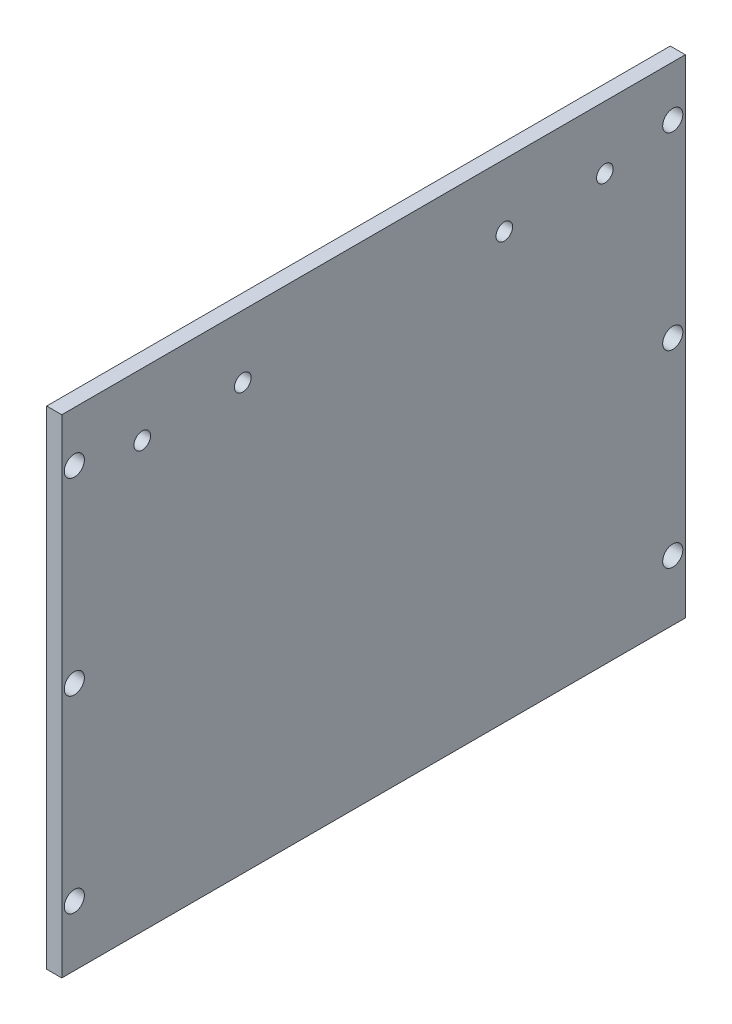
ISO-10303-21;
HEADER;
FILE_DESCRIPTION(('STEP AP214'),'2;1');
FILE_NAME('part.step','',(''),(''),'','','');
FILE_SCHEMA(('AUTOMOTIVE_DESIGN { 1 0 10303 214 1 1 1 1 }'));
ENDSEC;
DATA;
#1=APPLICATION_CONTEXT('core data for automotive mechanical design processes');
#2=APPLICATION_PROTOCOL_DEFINITION('international standard','automotive_design',2000,#1);
#3=PRODUCT_CONTEXT('',#1,'mechanical');
#4=PRODUCT('Part','Part','',(#3));
#5=PRODUCT_RELATED_PRODUCT_CATEGORY('part','',(#4));
#6=PRODUCT_DEFINITION_FORMATION('','',#4);
#7=PRODUCT_DEFINITION_CONTEXT('part definition',#1,'design');
#8=PRODUCT_DEFINITION('design','',#6,#7);
#9=PRODUCT_DEFINITION_SHAPE('','',#8);
#10=(LENGTH_UNIT() NAMED_UNIT(*) SI_UNIT(.MILLI.,.METRE.));
#11=(NAMED_UNIT(*) PLANE_ANGLE_UNIT() SI_UNIT($,.RADIAN.));
#12=(NAMED_UNIT(*) SI_UNIT($,.STERADIAN.) SOLID_ANGLE_UNIT());
#13=UNCERTAINTY_MEASURE_WITH_UNIT(LENGTH_MEASURE(1.E-05),#10,'distance_accuracy_value','');
#14=(GEOMETRIC_REPRESENTATION_CONTEXT(3) GLOBAL_UNCERTAINTY_ASSIGNED_CONTEXT((#13)) GLOBAL_UNIT_ASSIGNED_CONTEXT((#10,
#11,#12)) REPRESENTATION_CONTEXT('',''));
#15=CARTESIAN_POINT('',(0.,0.,0.));
#16=DIRECTION('',(0.,0.,1.));
#17=DIRECTION('',(1.,0.,0.));
#18=AXIS2_PLACEMENT_3D('',#15,#16,#17);
#19=CARTESIAN_POINT('',(2.99999999999993,2.98999999999998,-162.));
#20=DIRECTION('',(-1.,0.,0.));
#21=DIRECTION('',(0.,0.,1.));
#22=AXIS2_PLACEMENT_3D('',#19,#20,#21);
#23=PLANE('',#22);
#24=CARTESIAN_POINT('',(2.99999999999995,15.,-40.5));
#25=DIRECTION('',(1.,0.,0.));
#26=DIRECTION('',(0.,0.,-1.));
#27=AXIS2_PLACEMENT_3D('',#24,#25,#26);
#28=CIRCLE('',#27,1.99999999999999);
#29=CARTESIAN_POINT('',(2.99999999999995,15.,-42.5));
#30=VERTEX_POINT('',#29);
#31=EDGE_CURVE('E207',#30,#30,#28,.T.);
#32=ORIENTED_EDGE('',*,*,#31,.F.);
#33=EDGE_LOOP('',(#32));
#34=FACE_BOUND('',#33,.T.);
#35=CARTESIAN_POINT('',(2.99999999999994,15.,-159.5));
#36=DIRECTION('',(1.,0.,0.));
#37=DIRECTION('',(0.,0.,-1.));
#38=AXIS2_PLACEMENT_3D('',#35,#36,#37);
#39=CIRCLE('',#38,1.99999999999999);
#40=CARTESIAN_POINT('',(2.99999999999994,15.,-161.5));
#41=VERTEX_POINT('',#40);
#42=EDGE_CURVE('E213',#41,#41,#39,.T.);
#43=ORIENTED_EDGE('',*,*,#42,.F.);
#44=EDGE_LOOP('',(#43));
#45=FACE_BOUND('',#44,.T.);
#46=CARTESIAN_POINT('',(2.99999999999994,52.5,-159.5));
#47=DIRECTION('',(1.,0.,0.));
#48=DIRECTION('',(0.,0.,-1.));
#49=AXIS2_PLACEMENT_3D('',#46,#47,#48);
#50=CIRCLE('',#49,1.99999999999999);
#51=CARTESIAN_POINT('',(2.99999999999994,52.5,-161.5));
#52=VERTEX_POINT('',#51);
#53=EDGE_CURVE('E219',#52,#52,#50,.T.);
#54=ORIENTED_EDGE('',*,*,#53,.F.);
#55=EDGE_LOOP('',(#54));
#56=FACE_BOUND('',#55,.T.);
#57=CARTESIAN_POINT('',(2.99999999999994,90.,-159.5));
#58=DIRECTION('',(1.,0.,0.));
#59=DIRECTION('',(0.,0.,-1.));
#60=AXIS2_PLACEMENT_3D('',#57,#58,#59);
#61=CIRCLE('',#60,1.99999999999999);
#62=CARTESIAN_POINT('',(2.99999999999994,90.,-161.5));
#63=VERTEX_POINT('',#62);
#64=EDGE_CURVE('E225',#63,#63,#61,.T.);
#65=ORIENTED_EDGE('',*,*,#64,.F.);
#66=EDGE_LOOP('',(#65));
#67=FACE_BOUND('',#66,.T.);
#68=DIRECTION('',(0.,1.,0.));
#69=VECTOR('',#68,1.);
#70=CARTESIAN_POINT('',(2.99999999999993,2.98999999999998,-162.));
#71=LINE('',#70,#69);
#72=CARTESIAN_POINT('',(2.99999999999993,3.,-162.));
#73=VERTEX_POINT('',#72);
#74=CARTESIAN_POINT('',(2.99999999999993,100.,-162.));
#75=VERTEX_POINT('',#74);
#76=EDGE_CURVE('E41',#73,#75,#71,.T.);
#77=ORIENTED_EDGE('',*,*,#76,.T.);
#78=DIRECTION('',(0.,0.,1.));
#79=VECTOR('',#78,1.);
#80=CARTESIAN_POINT('',(2.99999999999993,100.,-157.));
#81=LINE('',#80,#79);
#82=CARTESIAN_POINT('',(2.99999999999995,100.,-38.));
#83=VERTEX_POINT('',#82);
#84=EDGE_CURVE('E81',#75,#83,#81,.T.);
#85=ORIENTED_EDGE('',*,*,#84,.T.);
#86=DIRECTION('',(0.,1.,0.));
#87=VECTOR('',#86,1.);
#88=CARTESIAN_POINT('',(2.99999999999994,2.98999999999998,-38.));
#89=LINE('',#88,#87);
#90=CARTESIAN_POINT('',(2.99999999999994,3.,-38.));
#91=VERTEX_POINT('',#90);
#92=EDGE_CURVE('E95',#91,#83,#89,.T.);
#93=ORIENTED_EDGE('',*,*,#92,.F.);
#94=DIRECTION('',(0.,0.,1.));
#95=VECTOR('',#94,1.);
#96=CARTESIAN_POINT('',(2.99999999999993,3.,-157.));
#97=LINE('',#96,#95);
#98=EDGE_CURVE('E92',#73,#91,#97,.T.);
#99=ORIENTED_EDGE('',*,*,#98,.F.);
#100=EDGE_LOOP('',(#77,#85,#93,#99));
#101=FACE_BOUND('',#100,.T.);
#102=CARTESIAN_POINT('',(2.99999999999993,87.56,-146.));
#103=DIRECTION('',(1.,0.,0.));
#104=DIRECTION('',(0.,0.,-1.));
#105=AXIS2_PLACEMENT_3D('',#102,#103,#104);
#106=CIRCLE('',#105,1.64999999999998);
#107=CARTESIAN_POINT('',(2.99999999999993,87.56,-147.65));
#108=VERTEX_POINT('',#107);
#109=EDGE_CURVE('E46',#108,#108,#106,.T.);
#110=ORIENTED_EDGE('',*,*,#109,.F.);
#111=EDGE_LOOP('',(#110));
#112=FACE_BOUND('',#111,.T.);
#113=CARTESIAN_POINT('',(2.99999999999993,87.56,-126.));
#114=DIRECTION('',(1.,0.,0.));
#115=DIRECTION('',(0.,0.,-1.));
#116=AXIS2_PLACEMENT_3D('',#113,#114,#115);
#117=CIRCLE('',#116,1.64999999999998);
#118=CARTESIAN_POINT('',(2.99999999999993,87.56,-127.65));
#119=VERTEX_POINT('',#118);
#120=EDGE_CURVE('E118',#119,#119,#117,.T.);
#121=ORIENTED_EDGE('',*,*,#120,.F.);
#122=EDGE_LOOP('',(#121));
#123=FACE_BOUND('',#122,.T.);
#124=CARTESIAN_POINT('',(2.99999999999994,87.56,-74.));
#125=DIRECTION('',(1.,0.,0.));
#126=DIRECTION('',(0.,0.,-1.));
#127=AXIS2_PLACEMENT_3D('',#124,#125,#126);
#128=CIRCLE('',#127,1.64999999999998);
#129=CARTESIAN_POINT('',(2.99999999999994,87.56,-75.65));
#130=VERTEX_POINT('',#129);
#131=EDGE_CURVE('E112',#130,#130,#128,.T.);
#132=ORIENTED_EDGE('',*,*,#131,.F.);
#133=EDGE_LOOP('',(#132));
#134=FACE_BOUND('',#133,.T.);
#135=CARTESIAN_POINT('',(2.99999999999994,87.56,-54.));
#136=DIRECTION('',(1.,0.,0.));
#137=DIRECTION('',(0.,0.,-1.));
#138=AXIS2_PLACEMENT_3D('',#135,#136,#137);
#139=CIRCLE('',#138,1.64999999999998);
#140=CARTESIAN_POINT('',(2.99999999999994,87.56,-55.65));
#141=VERTEX_POINT('',#140);
#142=EDGE_CURVE('E87',#141,#141,#139,.T.);
#143=ORIENTED_EDGE('',*,*,#142,.F.);
#144=EDGE_LOOP('',(#143));
#145=FACE_BOUND('',#144,.T.);
#146=CARTESIAN_POINT('',(2.99999999999995,52.5,-40.5));
#147=DIRECTION('',(1.,0.,0.));
#148=DIRECTION('',(0.,0.,-1.));
#149=AXIS2_PLACEMENT_3D('',#146,#147,#148);
#150=CIRCLE('',#149,1.99999999999999);
#151=CARTESIAN_POINT('',(2.99999999999995,52.5,-42.5));
#152=VERTEX_POINT('',#151);
#153=EDGE_CURVE('E193',#152,#152,#150,.T.);
#154=ORIENTED_EDGE('',*,*,#153,.F.);
#155=EDGE_LOOP('',(#154));
#156=FACE_BOUND('',#155,.T.);
#157=CARTESIAN_POINT('',(2.99999999999995,90.,-40.5));
#158=DIRECTION('',(1.,0.,0.));
#159=DIRECTION('',(0.,0.,-1.));
#160=AXIS2_PLACEMENT_3D('',#157,#158,#159);
#161=CIRCLE('',#160,1.99999999999999);
#162=CARTESIAN_POINT('',(2.99999999999995,90.,-42.5));
#163=VERTEX_POINT('',#162);
#164=EDGE_CURVE('E196',#163,#163,#161,.T.);
#165=ORIENTED_EDGE('',*,*,#164,.F.);
#166=EDGE_LOOP('',(#165));
#167=FACE_BOUND('',#166,.T.);
#168=ADVANCED_FACE('F37',(#34,#45,#56,#67,#101,#112,#123,#134,#145,#156,#167),#23,.F.);
#169=CARTESIAN_POINT('',(-6.75406545866244,2.98999999999998,-162.));
#170=DIRECTION('',(0.,0.,1.));
#171=DIRECTION('',(1.,0.,0.));
#172=AXIS2_PLACEMENT_3D('',#169,#170,#171);
#173=PLANE('',#172);
#174=DIRECTION('',(0.,-1.,0.));
#175=VECTOR('',#174,1.);
#176=CARTESIAN_POINT('',(0.,100.,-162.));
#177=LINE('',#176,#175);
#178=CARTESIAN_POINT('',(0.,100.,-162.));
#179=VERTEX_POINT('',#178);
#180=CARTESIAN_POINT('',(0.,3.,-162.));
#181=VERTEX_POINT('',#180);
#182=EDGE_CURVE('E99',#179,#181,#177,.T.);
#183=ORIENTED_EDGE('',*,*,#182,.F.);
#184=DIRECTION('',(-1.,0.,0.));
#185=VECTOR('',#184,1.);
#186=CARTESIAN_POINT('',(8.,100.,-162.));
#187=LINE('',#186,#185);
#188=EDGE_CURVE('E54',#75,#179,#187,.T.);
#189=ORIENTED_EDGE('',*,*,#188,.F.);
#190=ORIENTED_EDGE('',*,*,#76,.F.);
#191=DIRECTION('',(1.,0.,0.));
#192=VECTOR('',#191,1.);
#193=CARTESIAN_POINT('',(0.,3.,-162.));
#194=LINE('',#193,#192);
#195=EDGE_CURVE('E129',#181,#73,#194,.T.);
#196=ORIENTED_EDGE('',*,*,#195,.F.);
#197=EDGE_LOOP('',(#183,#189,#190,#196));
#198=FACE_BOUND('',#197,.T.);
#199=ADVANCED_FACE('F97',(#198),#173,.F.);
#200=CARTESIAN_POINT('',(2.99999999999994,2.98999999999998,-38.));
#201=DIRECTION('',(0.,0.,-1.));
#202=DIRECTION('',(-1.,0.,0.));
#203=AXIS2_PLACEMENT_3D('',#200,#201,#202);
#204=PLANE('',#203);
#205=ORIENTED_EDGE('',*,*,#92,.T.);
#206=DIRECTION('',(1.,0.,0.));
#207=VECTOR('',#206,1.);
#208=CARTESIAN_POINT('',(8.,100.,-38.));
#209=LINE('',#208,#207);
#210=CARTESIAN_POINT('',(0.,100.,-38.));
#211=VERTEX_POINT('',#210);
#212=EDGE_CURVE('E83',#211,#83,#209,.T.);
#213=ORIENTED_EDGE('',*,*,#212,.F.);
#214=DIRECTION('',(0.,1.,0.));
#215=VECTOR('',#214,1.);
#216=CARTESIAN_POINT('',(0.,100.,-38.));
#217=LINE('',#216,#215);
#218=CARTESIAN_POINT('',(0.,3.,-38.));
#219=VERTEX_POINT('',#218);
#220=EDGE_CURVE('E62',#219,#211,#217,.T.);
#221=ORIENTED_EDGE('',*,*,#220,.F.);
#222=DIRECTION('',(-1.,0.,0.));
#223=VECTOR('',#222,1.);
#224=CARTESIAN_POINT('',(0.,3.,-38.));
#225=LINE('',#224,#223);
#226=EDGE_CURVE('E127',#91,#219,#225,.T.);
#227=ORIENTED_EDGE('',*,*,#226,.F.);
#228=EDGE_LOOP('',(#205,#213,#221,#227));
#229=FACE_BOUND('',#228,.T.);
#230=ADVANCED_FACE('F137',(#229),#204,.F.);
#231=CARTESIAN_POINT('',(0.,100.,-8.00000000000006));
#232=DIRECTION('',(1.,0.,0.));
#233=DIRECTION('',(0.,0.,-1.));
#234=AXIS2_PLACEMENT_3D('',#231,#232,#233);
#235=PLANE('',#234);
#236=CARTESIAN_POINT('',(0.,90.,-40.5));
#237=DIRECTION('',(1.,0.,0.));
#238=DIRECTION('',(0.,0.,-1.));
#239=AXIS2_PLACEMENT_3D('',#236,#237,#238);
#240=CIRCLE('',#239,2.);
#241=CARTESIAN_POINT('',(0.,90.,-42.5));
#242=VERTEX_POINT('',#241);
#243=EDGE_CURVE('E198',#242,#242,#240,.T.);
#244=ORIENTED_EDGE('',*,*,#243,.T.);
#245=EDGE_LOOP('',(#244));
#246=FACE_BOUND('',#245,.T.);
#247=CARTESIAN_POINT('',(0.,52.5,-40.5));
#248=DIRECTION('',(1.,0.,0.));
#249=DIRECTION('',(0.,0.,-1.));
#250=AXIS2_PLACEMENT_3D('',#247,#248,#249);
#251=CIRCLE('',#250,2.);
#252=CARTESIAN_POINT('',(0.,52.5,-42.5));
#253=VERTEX_POINT('',#252);
#254=EDGE_CURVE('E204',#253,#253,#251,.T.);
#255=ORIENTED_EDGE('',*,*,#254,.T.);
#256=EDGE_LOOP('',(#255));
#257=FACE_BOUND('',#256,.T.);
#258=CARTESIAN_POINT('',(0.,15.,-40.5));
#259=DIRECTION('',(1.,0.,0.));
#260=DIRECTION('',(0.,0.,-1.));
#261=AXIS2_PLACEMENT_3D('',#258,#259,#260);
#262=CIRCLE('',#261,2.);
#263=CARTESIAN_POINT('',(0.,15.,-42.5));
#264=VERTEX_POINT('',#263);
#265=EDGE_CURVE('E210',#264,#264,#262,.T.);
#266=ORIENTED_EDGE('',*,*,#265,.T.);
#267=EDGE_LOOP('',(#266));
#268=FACE_BOUND('',#267,.T.);
#269=CARTESIAN_POINT('',(0.,15.,-159.5));
#270=DIRECTION('',(1.,0.,0.));
#271=DIRECTION('',(0.,0.,-1.));
#272=AXIS2_PLACEMENT_3D('',#269,#270,#271);
#273=CIRCLE('',#272,2.);
#274=CARTESIAN_POINT('',(0.,15.,-161.5));
#275=VERTEX_POINT('',#274);
#276=EDGE_CURVE('E216',#275,#275,#273,.T.);
#277=ORIENTED_EDGE('',*,*,#276,.T.);
#278=EDGE_LOOP('',(#277));
#279=FACE_BOUND('',#278,.T.);
#280=CARTESIAN_POINT('',(0.,52.5,-159.5));
#281=DIRECTION('',(1.,0.,0.));
#282=DIRECTION('',(0.,0.,-1.));
#283=AXIS2_PLACEMENT_3D('',#280,#281,#282);
#284=CIRCLE('',#283,2.);
#285=CARTESIAN_POINT('',(0.,52.5,-161.5));
#286=VERTEX_POINT('',#285);
#287=EDGE_CURVE('E222',#286,#286,#284,.T.);
#288=ORIENTED_EDGE('',*,*,#287,.T.);
#289=EDGE_LOOP('',(#288));
#290=FACE_BOUND('',#289,.T.);
#291=CARTESIAN_POINT('',(0.,90.,-159.5));
#292=DIRECTION('',(1.,0.,0.));
#293=DIRECTION('',(0.,0.,-1.));
#294=AXIS2_PLACEMENT_3D('',#291,#292,#293);
#295=CIRCLE('',#294,2.);
#296=CARTESIAN_POINT('',(0.,90.,-161.5));
#297=VERTEX_POINT('',#296);
#298=EDGE_CURVE('E96',#297,#297,#295,.T.);
#299=ORIENTED_EDGE('',*,*,#298,.T.);
#300=EDGE_LOOP('',(#299));
#301=FACE_BOUND('',#300,.T.);
#302=CARTESIAN_POINT('',(0.,87.56,-146.));
#303=DIRECTION('',(-1.,0.,0.));
#304=DIRECTION('',(0.,0.,1.));
#305=AXIS2_PLACEMENT_3D('',#302,#303,#304);
#306=CIRCLE('',#305,1.64999999999998);
#307=CARTESIAN_POINT('',(0.,87.56,-144.35));
#308=VERTEX_POINT('',#307);
#309=EDGE_CURVE('E11',#308,#308,#306,.T.);
#310=ORIENTED_EDGE('',*,*,#309,.F.);
#311=EDGE_LOOP('',(#310));
#312=FACE_BOUND('',#311,.T.);
#313=CARTESIAN_POINT('',(0.,87.56,-126.));
#314=DIRECTION('',(-1.,0.,0.));
#315=DIRECTION('',(0.,0.,1.));
#316=AXIS2_PLACEMENT_3D('',#313,#314,#315);
#317=CIRCLE('',#316,1.64999999999998);
#318=CARTESIAN_POINT('',(0.,87.56,-124.35));
#319=VERTEX_POINT('',#318);
#320=EDGE_CURVE('E121',#319,#319,#317,.T.);
#321=ORIENTED_EDGE('',*,*,#320,.F.);
#322=EDGE_LOOP('',(#321));
#323=FACE_BOUND('',#322,.T.);
#324=CARTESIAN_POINT('',(0.,87.56,-74.));
#325=DIRECTION('',(-1.,0.,0.));
#326=DIRECTION('',(0.,0.,1.));
#327=AXIS2_PLACEMENT_3D('',#324,#325,#326);
#328=CIRCLE('',#327,1.64999999999998);
#329=CARTESIAN_POINT('',(0.,87.56,-72.35));
#330=VERTEX_POINT('',#329);
#331=EDGE_CURVE('E115',#330,#330,#328,.T.);
#332=ORIENTED_EDGE('',*,*,#331,.F.);
#333=EDGE_LOOP('',(#332));
#334=FACE_BOUND('',#333,.T.);
#335=CARTESIAN_POINT('',(0.,87.56,-54.));
#336=DIRECTION('',(-1.,0.,0.));
#337=DIRECTION('',(0.,0.,1.));
#338=AXIS2_PLACEMENT_3D('',#335,#336,#337);
#339=CIRCLE('',#338,1.64999999999998);
#340=CARTESIAN_POINT('',(0.,87.56,-52.35));
#341=VERTEX_POINT('',#340);
#342=EDGE_CURVE('E109',#341,#341,#339,.T.);
#343=ORIENTED_EDGE('',*,*,#342,.F.);
#344=EDGE_LOOP('',(#343));
#345=FACE_BOUND('',#344,.T.);
#346=DIRECTION('',(0.,0.,1.));
#347=VECTOR('',#346,1.);
#348=CARTESIAN_POINT('',(0.,3.,-8.00000000000006));
#349=LINE('',#348,#347);
#350=EDGE_CURVE('E101',#181,#219,#349,.T.);
#351=ORIENTED_EDGE('',*,*,#350,.T.);
#352=ORIENTED_EDGE('',*,*,#220,.T.);
#353=DIRECTION('',(0.,0.,1.));
#354=VECTOR('',#353,1.);
#355=CARTESIAN_POINT('',(0.,100.,-8.00000000000006));
#356=LINE('',#355,#354);
#357=EDGE_CURVE('E88',#179,#211,#356,.T.);
#358=ORIENTED_EDGE('',*,*,#357,.F.);
#359=ORIENTED_EDGE('',*,*,#182,.T.);
#360=EDGE_LOOP('',(#351,#352,#358,#359));
#361=FACE_BOUND('',#360,.T.);
#362=ADVANCED_FACE('F132',(#246,#257,#268,#279,#290,#301,#312,#323,#334,#345,#361),#235,.F.);
#363=CARTESIAN_POINT('',(8.,100.,-192.));
#364=DIRECTION('',(0.,-1.,0.));
#365=DIRECTION('',(0.,0.,-1.));
#366=AXIS2_PLACEMENT_3D('',#363,#364,#365);
#367=PLANE('',#366);
#368=ORIENTED_EDGE('',*,*,#212,.T.);
#369=ORIENTED_EDGE('',*,*,#84,.F.);
#370=ORIENTED_EDGE('',*,*,#188,.T.);
#371=ORIENTED_EDGE('',*,*,#357,.T.);
#372=EDGE_LOOP('',(#368,#369,#370,#371));
#373=FACE_BOUND('',#372,.T.);
#374=ADVANCED_FACE('F39',(#373),#367,.F.);
#375=CARTESIAN_POINT('',(0.,3.,0.01000000000001));
#376=DIRECTION('',(0.,1.,0.));
#377=DIRECTION('',(-1.,0.,0.));
#378=AXIS2_PLACEMENT_3D('',#375,#376,#377);
#379=PLANE('',#378);
#380=ORIENTED_EDGE('',*,*,#98,.T.);
#381=ORIENTED_EDGE('',*,*,#226,.T.);
#382=ORIENTED_EDGE('',*,*,#350,.F.);
#383=ORIENTED_EDGE('',*,*,#195,.T.);
#384=EDGE_LOOP('',(#380,#381,#382,#383));
#385=FACE_BOUND('',#384,.T.);
#386=ADVANCED_FACE('F134',(#385),#379,.F.);
#387=CARTESIAN_POINT('',(0.,87.56,-54.));
#388=DIRECTION('',(-1.,0.,0.));
#389=DIRECTION('',(0.,0.,1.));
#390=AXIS2_PLACEMENT_3D('',#387,#388,#389);
#391=CYLINDRICAL_SURFACE('',#390,1.64999999999998);
#392=ORIENTED_EDGE('',*,*,#142,.T.);
#393=EDGE_LOOP('',(#392));
#394=FACE_BOUND('',#393,.T.);
#395=ORIENTED_EDGE('',*,*,#342,.T.);
#396=EDGE_LOOP('',(#395));
#397=FACE_BOUND('',#396,.T.);
#398=ADVANCED_FACE('F162',(#394,#397),#391,.F.);
#399=CARTESIAN_POINT('',(0.,87.56,-74.));
#400=DIRECTION('',(-1.,0.,0.));
#401=DIRECTION('',(0.,0.,1.));
#402=AXIS2_PLACEMENT_3D('',#399,#400,#401);
#403=CYLINDRICAL_SURFACE('',#402,1.64999999999998);
#404=ORIENTED_EDGE('',*,*,#131,.T.);
#405=EDGE_LOOP('',(#404));
#406=FACE_BOUND('',#405,.T.);
#407=ORIENTED_EDGE('',*,*,#331,.T.);
#408=EDGE_LOOP('',(#407));
#409=FACE_BOUND('',#408,.T.);
#410=ADVANCED_FACE('F165',(#406,#409),#403,.F.);
#411=CARTESIAN_POINT('',(0.,87.56,-126.));
#412=DIRECTION('',(-1.,0.,0.));
#413=DIRECTION('',(0.,0.,1.));
#414=AXIS2_PLACEMENT_3D('',#411,#412,#413);
#415=CYLINDRICAL_SURFACE('',#414,1.64999999999998);
#416=ORIENTED_EDGE('',*,*,#120,.T.);
#417=EDGE_LOOP('',(#416));
#418=FACE_BOUND('',#417,.T.);
#419=ORIENTED_EDGE('',*,*,#320,.T.);
#420=EDGE_LOOP('',(#419));
#421=FACE_BOUND('',#420,.T.);
#422=ADVANCED_FACE('F151',(#418,#421),#415,.F.);
#423=CARTESIAN_POINT('',(0.,87.56,-146.));
#424=DIRECTION('',(-1.,0.,0.));
#425=DIRECTION('',(0.,0.,1.));
#426=AXIS2_PLACEMENT_3D('',#423,#424,#425);
#427=CYLINDRICAL_SURFACE('',#426,1.64999999999998);
#428=ORIENTED_EDGE('',*,*,#109,.T.);
#429=EDGE_LOOP('',(#428));
#430=FACE_BOUND('',#429,.T.);
#431=ORIENTED_EDGE('',*,*,#309,.T.);
#432=EDGE_LOOP('',(#431));
#433=FACE_BOUND('',#432,.T.);
#434=ADVANCED_FACE('F140',(#430,#433),#427,.F.);
#435=CARTESIAN_POINT('',(2.99999999999994,90.,-159.5));
#436=DIRECTION('',(1.,0.,0.));
#437=DIRECTION('',(0.,0.,-1.));
#438=AXIS2_PLACEMENT_3D('',#435,#436,#437);
#439=CYLINDRICAL_SURFACE('',#438,1.99999999999999);
#440=ORIENTED_EDGE('',*,*,#298,.F.);
#441=EDGE_LOOP('',(#440));
#442=FACE_BOUND('',#441,.T.);
#443=ORIENTED_EDGE('',*,*,#64,.T.);
#444=EDGE_LOOP('',(#443));
#445=FACE_BOUND('',#444,.T.);
#446=ADVANCED_FACE('F147',(#442,#445),#439,.F.);
#447=CARTESIAN_POINT('',(2.99999999999994,52.5,-159.5));
#448=DIRECTION('',(1.,0.,0.));
#449=DIRECTION('',(0.,0.,-1.));
#450=AXIS2_PLACEMENT_3D('',#447,#448,#449);
#451=CYLINDRICAL_SURFACE('',#450,1.99999999999999);
#452=ORIENTED_EDGE('',*,*,#287,.F.);
#453=EDGE_LOOP('',(#452));
#454=FACE_BOUND('',#453,.T.);
#455=ORIENTED_EDGE('',*,*,#53,.T.);
#456=EDGE_LOOP('',(#455));
#457=FACE_BOUND('',#456,.T.);
#458=ADVANCED_FACE('F235',(#454,#457),#451,.F.);
#459=CARTESIAN_POINT('',(2.99999999999994,15.,-159.5));
#460=DIRECTION('',(1.,0.,0.));
#461=DIRECTION('',(0.,0.,-1.));
#462=AXIS2_PLACEMENT_3D('',#459,#460,#461);
#463=CYLINDRICAL_SURFACE('',#462,1.99999999999999);
#464=ORIENTED_EDGE('',*,*,#276,.F.);
#465=EDGE_LOOP('',(#464));
#466=FACE_BOUND('',#465,.T.);
#467=ORIENTED_EDGE('',*,*,#42,.T.);
#468=EDGE_LOOP('',(#467));
#469=FACE_BOUND('',#468,.T.);
#470=ADVANCED_FACE('F241',(#466,#469),#463,.F.);
#471=CARTESIAN_POINT('',(2.99999999999995,15.,-40.5));
#472=DIRECTION('',(1.,0.,0.));
#473=DIRECTION('',(0.,0.,-1.));
#474=AXIS2_PLACEMENT_3D('',#471,#472,#473);
#475=CYLINDRICAL_SURFACE('',#474,1.99999999999999);
#476=ORIENTED_EDGE('',*,*,#265,.F.);
#477=EDGE_LOOP('',(#476));
#478=FACE_BOUND('',#477,.T.);
#479=ORIENTED_EDGE('',*,*,#31,.T.);
#480=EDGE_LOOP('',(#479));
#481=FACE_BOUND('',#480,.T.);
#482=ADVANCED_FACE('F247',(#478,#481),#475,.F.);
#483=CARTESIAN_POINT('',(2.99999999999995,52.5,-40.5));
#484=DIRECTION('',(1.,0.,0.));
#485=DIRECTION('',(0.,0.,-1.));
#486=AXIS2_PLACEMENT_3D('',#483,#484,#485);
#487=CYLINDRICAL_SURFACE('',#486,1.99999999999999);
#488=ORIENTED_EDGE('',*,*,#254,.F.);
#489=EDGE_LOOP('',(#488));
#490=FACE_BOUND('',#489,.T.);
#491=ORIENTED_EDGE('',*,*,#153,.T.);
#492=EDGE_LOOP('',(#491));
#493=FACE_BOUND('',#492,.T.);
#494=ADVANCED_FACE('F251',(#490,#493),#487,.F.);
#495=CARTESIAN_POINT('',(2.99999999999995,90.,-40.5));
#496=DIRECTION('',(1.,0.,0.));
#497=DIRECTION('',(0.,0.,-1.));
#498=AXIS2_PLACEMENT_3D('',#495,#496,#497);
#499=CYLINDRICAL_SURFACE('',#498,1.99999999999999);
#500=ORIENTED_EDGE('',*,*,#243,.F.);
#501=EDGE_LOOP('',(#500));
#502=FACE_BOUND('',#501,.T.);
#503=ORIENTED_EDGE('',*,*,#164,.T.);
#504=EDGE_LOOP('',(#503));
#505=FACE_BOUND('',#504,.T.);
#506=ADVANCED_FACE('F255',(#502,#505),#499,.F.);
#507=CLOSED_SHELL('',(#168,#199,#230,#362,#374,#386,#398,#410,#422,#434,#446,#458,#470,#482,
#494,#506));
#508=MANIFOLD_SOLID_BREP('B2',#507);
#509=ADVANCED_BREP_SHAPE_REPRESENTATION('',(#18,#508),#14);
#510=SHAPE_DEFINITION_REPRESENTATION(#9,#509);
ENDSEC;
END-ISO-10303-21;
